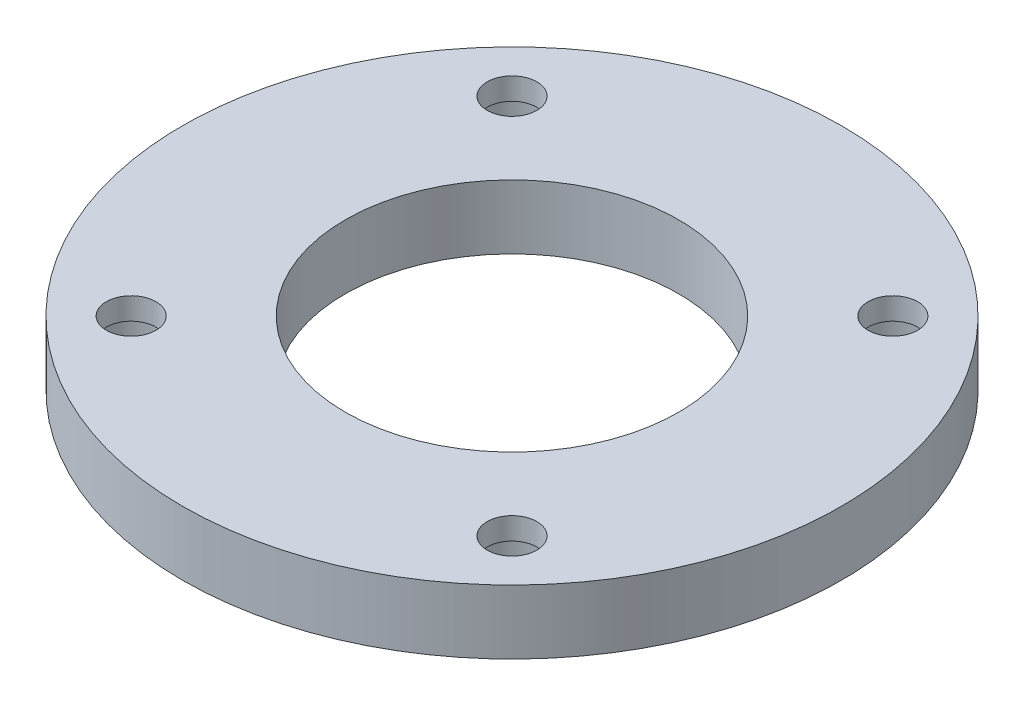
ISO-10303-21;
HEADER;
FILE_DESCRIPTION(('STEP AP214'),'2;1');
FILE_NAME('part.step','',(''),(''),'','','');
FILE_SCHEMA(('AUTOMOTIVE_DESIGN { 1 0 10303 214 1 1 1 1 }'));
ENDSEC;
DATA;
#1=APPLICATION_CONTEXT('core data for automotive mechanical design processes');
#2=APPLICATION_PROTOCOL_DEFINITION('international standard','automotive_design',2000,#1);
#3=PRODUCT_CONTEXT('',#1,'mechanical');
#4=PRODUCT('Part','Part','',(#3));
#5=PRODUCT_RELATED_PRODUCT_CATEGORY('part','',(#4));
#6=PRODUCT_DEFINITION_FORMATION('','',#4);
#7=PRODUCT_DEFINITION_CONTEXT('part definition',#1,'design');
#8=PRODUCT_DEFINITION('design','',#6,#7);
#9=PRODUCT_DEFINITION_SHAPE('','',#8);
#10=(LENGTH_UNIT() NAMED_UNIT(*) SI_UNIT(.MILLI.,.METRE.));
#11=(NAMED_UNIT(*) PLANE_ANGLE_UNIT() SI_UNIT($,.RADIAN.));
#12=(NAMED_UNIT(*) SI_UNIT($,.STERADIAN.) SOLID_ANGLE_UNIT());
#13=UNCERTAINTY_MEASURE_WITH_UNIT(LENGTH_MEASURE(1.E-05),#10,'distance_accuracy_value','');
#14=(GEOMETRIC_REPRESENTATION_CONTEXT(3) GLOBAL_UNCERTAINTY_ASSIGNED_CONTEXT((#13)) GLOBAL_UNIT_ASSIGNED_CONTEXT((#10,
#11,#12)) REPRESENTATION_CONTEXT('',''));
#15=CARTESIAN_POINT('',(0.,0.,0.));
#16=DIRECTION('',(0.,0.,1.));
#17=DIRECTION('',(1.,0.,0.));
#18=AXIS2_PLACEMENT_3D('',#15,#16,#17);
#19=CARTESIAN_POINT('',(0.,6.35,0.));
#20=DIRECTION('',(0.,1.,0.));
#21=DIRECTION('',(0.,0.,1.));
#22=AXIS2_PLACEMENT_3D('',#19,#20,#21);
#23=PLANE('',#22);
#24=CARTESIAN_POINT('',(-18.8585378542452,6.35,18.8585378542452));
#25=DIRECTION('',(0.,-1.,0.));
#26=DIRECTION('',(0.,0.,-1.));
#27=AXIS2_PLACEMENT_3D('',#24,#25,#26);
#28=CIRCLE('',#27,2.45745);
#29=CARTESIAN_POINT('',(-18.8585378542452,6.35,16.4010878542452));
#30=VERTEX_POINT('',#29);
#31=EDGE_CURVE('E86',#30,#30,#28,.T.);
#32=ORIENTED_EDGE('',*,*,#31,.T.);
#33=EDGE_LOOP('',(#32));
#34=FACE_BOUND('',#33,.T.);
#35=CARTESIAN_POINT('',(18.8585378542452,6.35,18.8585378542452));
#36=DIRECTION('',(0.,-1.,0.));
#37=DIRECTION('',(0.,0.,-1.));
#38=AXIS2_PLACEMENT_3D('',#35,#36,#37);
#39=CIRCLE('',#38,2.45745);
#40=CARTESIAN_POINT('',(18.8585378542452,6.35,16.4010878542452));
#41=VERTEX_POINT('',#40);
#42=EDGE_CURVE('E74',#41,#41,#39,.T.);
#43=ORIENTED_EDGE('',*,*,#42,.T.);
#44=EDGE_LOOP('',(#43));
#45=FACE_BOUND('',#44,.T.);
#46=CARTESIAN_POINT('',(18.8585378542452,6.35,-18.8585378542452));
#47=DIRECTION('',(0.,-1.,0.));
#48=DIRECTION('',(0.,0.,-1.));
#49=AXIS2_PLACEMENT_3D('',#46,#47,#48);
#50=CIRCLE('',#49,2.45745);
#51=CARTESIAN_POINT('',(18.8585378542452,6.35,-21.3159878542452));
#52=VERTEX_POINT('',#51);
#53=EDGE_CURVE('E62',#52,#52,#50,.T.);
#54=ORIENTED_EDGE('',*,*,#53,.T.);
#55=EDGE_LOOP('',(#54));
#56=FACE_BOUND('',#55,.T.);
#57=CARTESIAN_POINT('',(-18.8585378542452,6.35,-18.8585378542452));
#58=DIRECTION('',(0.,-1.,0.));
#59=DIRECTION('',(0.,0.,-1.));
#60=AXIS2_PLACEMENT_3D('',#57,#58,#59);
#61=CIRCLE('',#60,2.45745);
#62=CARTESIAN_POINT('',(-18.8585378542452,6.35,-21.3159878542452));
#63=VERTEX_POINT('',#62);
#64=EDGE_CURVE('E48',#63,#63,#61,.T.);
#65=ORIENTED_EDGE('',*,*,#64,.T.);
#66=EDGE_LOOP('',(#65));
#67=FACE_BOUND('',#66,.T.);
#68=CARTESIAN_POINT('',(0.,6.35,0.));
#69=DIRECTION('',(0.,1.,0.));
#70=DIRECTION('',(0.,0.,1.));
#71=AXIS2_PLACEMENT_3D('',#68,#69,#70);
#72=CIRCLE('',#71,32.639);
#73=CARTESIAN_POINT('',(0.,6.35,32.639));
#74=VERTEX_POINT('',#73);
#75=EDGE_CURVE('E10',#74,#74,#72,.T.);
#76=ORIENTED_EDGE('',*,*,#75,.T.);
#77=EDGE_LOOP('',(#76));
#78=FACE_BOUND('',#77,.T.);
#79=CARTESIAN_POINT('',(0.,6.35,0.));
#80=DIRECTION('',(0.,1.,0.));
#81=DIRECTION('',(0.,0.,1.));
#82=AXIS2_PLACEMENT_3D('',#79,#80,#81);
#83=CIRCLE('',#82,16.51);
#84=CARTESIAN_POINT('',(0.,6.35,16.51));
#85=VERTEX_POINT('',#84);
#86=EDGE_CURVE('E43',#85,#85,#83,.T.);
#87=ORIENTED_EDGE('',*,*,#86,.F.);
#88=EDGE_LOOP('',(#87));
#89=FACE_BOUND('',#88,.T.);
#90=ADVANCED_FACE('F32',(#34,#45,#56,#67,#78,#89),#23,.T.);
#91=CARTESIAN_POINT('',(0.,0.,0.));
#92=DIRECTION('',(0.,1.,0.));
#93=DIRECTION('',(0.,0.,1.));
#94=AXIS2_PLACEMENT_3D('',#91,#92,#93);
#95=PLANE('',#94);
#96=CARTESIAN_POINT('',(-18.8585378542452,0.,18.8585378542452));
#97=DIRECTION('',(0.,-1.,0.));
#98=DIRECTION('',(0.,0.,-1.));
#99=AXIS2_PLACEMENT_3D('',#96,#97,#98);
#100=CIRCLE('',#99,3.96875);
#101=CARTESIAN_POINT('',(-18.8585378542452,0.,14.8897878542452));
#102=VERTEX_POINT('',#101);
#103=EDGE_CURVE('E95',#102,#102,#100,.T.);
#104=ORIENTED_EDGE('',*,*,#103,.F.);
#105=EDGE_LOOP('',(#104));
#106=FACE_BOUND('',#105,.T.);
#107=CARTESIAN_POINT('',(18.8585378542452,0.,18.8585378542452));
#108=DIRECTION('',(0.,-1.,0.));
#109=DIRECTION('',(0.,0.,-1.));
#110=AXIS2_PLACEMENT_3D('',#107,#108,#109);
#111=CIRCLE('',#110,3.96875);
#112=CARTESIAN_POINT('',(18.8585378542452,0.,14.8897878542452));
#113=VERTEX_POINT('',#112);
#114=EDGE_CURVE('E83',#113,#113,#111,.T.);
#115=ORIENTED_EDGE('',*,*,#114,.F.);
#116=EDGE_LOOP('',(#115));
#117=FACE_BOUND('',#116,.T.);
#118=CARTESIAN_POINT('',(18.8585378542452,0.,-18.8585378542452));
#119=DIRECTION('',(0.,-1.,0.));
#120=DIRECTION('',(0.,0.,-1.));
#121=AXIS2_PLACEMENT_3D('',#118,#119,#120);
#122=CIRCLE('',#121,3.96875);
#123=CARTESIAN_POINT('',(18.8585378542452,0.,-22.8272878542452));
#124=VERTEX_POINT('',#123);
#125=EDGE_CURVE('E71',#124,#124,#122,.T.);
#126=ORIENTED_EDGE('',*,*,#125,.F.);
#127=EDGE_LOOP('',(#126));
#128=FACE_BOUND('',#127,.T.);
#129=CARTESIAN_POINT('',(-18.8585378542452,0.,-18.8585378542452));
#130=DIRECTION('',(0.,-1.,0.));
#131=DIRECTION('',(0.,0.,-1.));
#132=AXIS2_PLACEMENT_3D('',#129,#130,#131);
#133=CIRCLE('',#132,3.96875);
#134=CARTESIAN_POINT('',(-18.8585378542452,0.,-22.8272878542452));
#135=VERTEX_POINT('',#134);
#136=EDGE_CURVE('E59',#135,#135,#133,.T.);
#137=ORIENTED_EDGE('',*,*,#136,.F.);
#138=EDGE_LOOP('',(#137));
#139=FACE_BOUND('',#138,.T.);
#140=CARTESIAN_POINT('',(0.,0.,0.));
#141=DIRECTION('',(0.,1.,0.));
#142=DIRECTION('',(0.,0.,1.));
#143=AXIS2_PLACEMENT_3D('',#140,#141,#142);
#144=CIRCLE('',#143,32.639);
#145=CARTESIAN_POINT('',(0.,0.,32.639));
#146=VERTEX_POINT('',#145);
#147=EDGE_CURVE('E36',#146,#146,#144,.T.);
#148=ORIENTED_EDGE('',*,*,#147,.F.);
#149=EDGE_LOOP('',(#148));
#150=FACE_BOUND('',#149,.T.);
#151=CARTESIAN_POINT('',(0.,0.,0.));
#152=DIRECTION('',(0.,1.,0.));
#153=DIRECTION('',(0.,0.,1.));
#154=AXIS2_PLACEMENT_3D('',#151,#152,#153);
#155=CIRCLE('',#154,16.51);
#156=CARTESIAN_POINT('',(0.,0.,16.51));
#157=VERTEX_POINT('',#156);
#158=EDGE_CURVE('E45',#157,#157,#155,.T.);
#159=ORIENTED_EDGE('',*,*,#158,.T.);
#160=EDGE_LOOP('',(#159));
#161=FACE_BOUND('',#160,.T.);
#162=ADVANCED_FACE('F101',(#106,#117,#128,#139,#150,#161),#95,.F.);
#163=CARTESIAN_POINT('',(0.,6.35,0.));
#164=DIRECTION('',(0.,-1.,0.));
#165=DIRECTION('',(0.,0.,-1.));
#166=AXIS2_PLACEMENT_3D('',#163,#164,#165);
#167=CYLINDRICAL_SURFACE('',#166,32.639);
#168=ORIENTED_EDGE('',*,*,#75,.F.);
#169=EDGE_LOOP('',(#168));
#170=FACE_BOUND('',#169,.T.);
#171=ORIENTED_EDGE('',*,*,#147,.T.);
#172=EDGE_LOOP('',(#171));
#173=FACE_BOUND('',#172,.T.);
#174=ADVANCED_FACE('F34',(#170,#173),#167,.T.);
#175=CARTESIAN_POINT('',(0.,6.35,0.));
#176=DIRECTION('',(0.,-1.,0.));
#177=DIRECTION('',(0.,0.,-1.));
#178=AXIS2_PLACEMENT_3D('',#175,#176,#177);
#179=CYLINDRICAL_SURFACE('',#178,16.51);
#180=ORIENTED_EDGE('',*,*,#86,.T.);
#181=EDGE_LOOP('',(#180));
#182=FACE_BOUND('',#181,.T.);
#183=ORIENTED_EDGE('',*,*,#158,.F.);
#184=EDGE_LOOP('',(#183));
#185=FACE_BOUND('',#184,.T.);
#186=ADVANCED_FACE('F114',(#182,#185),#179,.F.);
#187=CARTESIAN_POINT('',(-18.8585378542452,0.,-18.8585378542452));
#188=DIRECTION('',(0.,-1.,0.));
#189=DIRECTION('',(0.,0.,-1.));
#190=AXIS2_PLACEMENT_3D('',#187,#188,#189);
#191=CYLINDRICAL_SURFACE('',#190,2.45745);
#192=ORIENTED_EDGE('',*,*,#64,.F.);
#193=EDGE_LOOP('',(#192));
#194=FACE_BOUND('',#193,.T.);
#195=CARTESIAN_POINT('',(-18.8585378542452,4.1656,-18.8585378542452));
#196=DIRECTION('',(0.,-1.,0.));
#197=DIRECTION('',(0.,0.,-1.));
#198=AXIS2_PLACEMENT_3D('',#195,#196,#197);
#199=CIRCLE('',#198,2.45745);
#200=CARTESIAN_POINT('',(-18.8585378542452,4.1656,-21.3159878542452));
#201=VERTEX_POINT('',#200);
#202=EDGE_CURVE('E53',#201,#201,#199,.T.);
#203=ORIENTED_EDGE('',*,*,#202,.T.);
#204=EDGE_LOOP('',(#203));
#205=FACE_BOUND('',#204,.T.);
#206=ADVANCED_FACE('F116',(#194,#205),#191,.F.);
#207=CARTESIAN_POINT('',(-16.4010878542452,4.1656,-18.8585378542452));
#208=DIRECTION('',(0.,1.,0.));
#209=DIRECTION('',(0.,0.,1.));
#210=AXIS2_PLACEMENT_3D('',#207,#208,#209);
#211=PLANE('',#210);
#212=ORIENTED_EDGE('',*,*,#202,.F.);
#213=EDGE_LOOP('',(#212));
#214=FACE_BOUND('',#213,.T.);
#215=CARTESIAN_POINT('',(-18.8585378542452,4.1656,-18.8585378542452));
#216=DIRECTION('',(0.,-1.,0.));
#217=DIRECTION('',(0.,0.,-1.));
#218=AXIS2_PLACEMENT_3D('',#215,#216,#217);
#219=CIRCLE('',#218,3.96875);
#220=CARTESIAN_POINT('',(-18.8585378542452,4.1656,-22.8272878542452));
#221=VERTEX_POINT('',#220);
#222=EDGE_CURVE('E56',#221,#221,#219,.T.);
#223=ORIENTED_EDGE('',*,*,#222,.T.);
#224=EDGE_LOOP('',(#223));
#225=FACE_BOUND('',#224,.T.);
#226=ADVANCED_FACE('F123',(#214,#225),#211,.F.);
#227=CARTESIAN_POINT('',(-18.8585378542452,0.,-18.8585378542452));
#228=DIRECTION('',(0.,-1.,0.));
#229=DIRECTION('',(0.,0.,-1.));
#230=AXIS2_PLACEMENT_3D('',#227,#228,#229);
#231=CYLINDRICAL_SURFACE('',#230,3.96875);
#232=ORIENTED_EDGE('',*,*,#222,.F.);
#233=EDGE_LOOP('',(#232));
#234=FACE_BOUND('',#233,.T.);
#235=ORIENTED_EDGE('',*,*,#136,.T.);
#236=EDGE_LOOP('',(#235));
#237=FACE_BOUND('',#236,.T.);
#238=ADVANCED_FACE('F146',(#234,#237),#231,.F.);
#239=CARTESIAN_POINT('',(18.8585378542452,0.,-18.8585378542452));
#240=DIRECTION('',(0.,-1.,0.));
#241=DIRECTION('',(0.,0.,-1.));
#242=AXIS2_PLACEMENT_3D('',#239,#240,#241);
#243=CYLINDRICAL_SURFACE('',#242,2.45745);
#244=ORIENTED_EDGE('',*,*,#53,.F.);
#245=EDGE_LOOP('',(#244));
#246=FACE_BOUND('',#245,.T.);
#247=CARTESIAN_POINT('',(18.8585378542452,4.1656,-18.8585378542452));
#248=DIRECTION('',(0.,-1.,0.));
#249=DIRECTION('',(0.,0.,-1.));
#250=AXIS2_PLACEMENT_3D('',#247,#248,#249);
#251=CIRCLE('',#250,2.45745);
#252=CARTESIAN_POINT('',(18.8585378542452,4.1656,-21.3159878542452));
#253=VERTEX_POINT('',#252);
#254=EDGE_CURVE('E65',#253,#253,#251,.T.);
#255=ORIENTED_EDGE('',*,*,#254,.T.);
#256=EDGE_LOOP('',(#255));
#257=FACE_BOUND('',#256,.T.);
#258=ADVANCED_FACE('F152',(#246,#257),#243,.F.);
#259=CARTESIAN_POINT('',(21.3159878542452,4.1656,-18.8585378542452));
#260=DIRECTION('',(0.,1.,0.));
#261=DIRECTION('',(0.,0.,1.));
#262=AXIS2_PLACEMENT_3D('',#259,#260,#261);
#263=PLANE('',#262);
#264=ORIENTED_EDGE('',*,*,#254,.F.);
#265=EDGE_LOOP('',(#264));
#266=FACE_BOUND('',#265,.T.);
#267=CARTESIAN_POINT('',(18.8585378542452,4.1656,-18.8585378542452));
#268=DIRECTION('',(0.,-1.,0.));
#269=DIRECTION('',(0.,0.,-1.));
#270=AXIS2_PLACEMENT_3D('',#267,#268,#269);
#271=CIRCLE('',#270,3.96875);
#272=CARTESIAN_POINT('',(18.8585378542452,4.1656,-22.8272878542452));
#273=VERTEX_POINT('',#272);
#274=EDGE_CURVE('E68',#273,#273,#271,.T.);
#275=ORIENTED_EDGE('',*,*,#274,.T.);
#276=EDGE_LOOP('',(#275));
#277=FACE_BOUND('',#276,.T.);
#278=ADVANCED_FACE('F157',(#266,#277),#263,.F.);
#279=CARTESIAN_POINT('',(18.8585378542452,0.,-18.8585378542452));
#280=DIRECTION('',(0.,-1.,0.));
#281=DIRECTION('',(0.,0.,-1.));
#282=AXIS2_PLACEMENT_3D('',#279,#280,#281);
#283=CYLINDRICAL_SURFACE('',#282,3.96875);
#284=ORIENTED_EDGE('',*,*,#274,.F.);
#285=EDGE_LOOP('',(#284));
#286=FACE_BOUND('',#285,.T.);
#287=ORIENTED_EDGE('',*,*,#125,.T.);
#288=EDGE_LOOP('',(#287));
#289=FACE_BOUND('',#288,.T.);
#290=ADVANCED_FACE('F163',(#286,#289),#283,.F.);
#291=CARTESIAN_POINT('',(18.8585378542452,0.,18.8585378542452));
#292=DIRECTION('',(0.,-1.,0.));
#293=DIRECTION('',(0.,0.,-1.));
#294=AXIS2_PLACEMENT_3D('',#291,#292,#293);
#295=CYLINDRICAL_SURFACE('',#294,2.45745);
#296=ORIENTED_EDGE('',*,*,#42,.F.);
#297=EDGE_LOOP('',(#296));
#298=FACE_BOUND('',#297,.T.);
#299=CARTESIAN_POINT('',(18.8585378542452,4.1656,18.8585378542452));
#300=DIRECTION('',(0.,-1.,0.));
#301=DIRECTION('',(0.,0.,-1.));
#302=AXIS2_PLACEMENT_3D('',#299,#300,#301);
#303=CIRCLE('',#302,2.45745);
#304=CARTESIAN_POINT('',(18.8585378542452,4.1656,16.4010878542452));
#305=VERTEX_POINT('',#304);
#306=EDGE_CURVE('E77',#305,#305,#303,.T.);
#307=ORIENTED_EDGE('',*,*,#306,.T.);
#308=EDGE_LOOP('',(#307));
#309=FACE_BOUND('',#308,.T.);
#310=ADVANCED_FACE('F167',(#298,#309),#295,.F.);
#311=CARTESIAN_POINT('',(21.3159878542452,4.1656,18.8585378542452));
#312=DIRECTION('',(0.,1.,0.));
#313=DIRECTION('',(0.,0.,1.));
#314=AXIS2_PLACEMENT_3D('',#311,#312,#313);
#315=PLANE('',#314);
#316=ORIENTED_EDGE('',*,*,#306,.F.);
#317=EDGE_LOOP('',(#316));
#318=FACE_BOUND('',#317,.T.);
#319=CARTESIAN_POINT('',(18.8585378542452,4.1656,18.8585378542452));
#320=DIRECTION('',(0.,-1.,0.));
#321=DIRECTION('',(0.,0.,-1.));
#322=AXIS2_PLACEMENT_3D('',#319,#320,#321);
#323=CIRCLE('',#322,3.96875);
#324=CARTESIAN_POINT('',(18.8585378542452,4.1656,14.8897878542452));
#325=VERTEX_POINT('',#324);
#326=EDGE_CURVE('E80',#325,#325,#323,.T.);
#327=ORIENTED_EDGE('',*,*,#326,.T.);
#328=EDGE_LOOP('',(#327));
#329=FACE_BOUND('',#328,.T.);
#330=ADVANCED_FACE('F171',(#318,#329),#315,.F.);
#331=CARTESIAN_POINT('',(18.8585378542452,0.,18.8585378542452));
#332=DIRECTION('',(0.,-1.,0.));
#333=DIRECTION('',(0.,0.,-1.));
#334=AXIS2_PLACEMENT_3D('',#331,#332,#333);
#335=CYLINDRICAL_SURFACE('',#334,3.96875);
#336=ORIENTED_EDGE('',*,*,#326,.F.);
#337=EDGE_LOOP('',(#336));
#338=FACE_BOUND('',#337,.T.);
#339=ORIENTED_EDGE('',*,*,#114,.T.);
#340=EDGE_LOOP('',(#339));
#341=FACE_BOUND('',#340,.T.);
#342=ADVANCED_FACE('F175',(#338,#341),#335,.F.);
#343=CARTESIAN_POINT('',(-18.8585378542452,0.,18.8585378542452));
#344=DIRECTION('',(0.,-1.,0.));
#345=DIRECTION('',(0.,0.,-1.));
#346=AXIS2_PLACEMENT_3D('',#343,#344,#345);
#347=CYLINDRICAL_SURFACE('',#346,2.45745);
#348=ORIENTED_EDGE('',*,*,#31,.F.);
#349=EDGE_LOOP('',(#348));
#350=FACE_BOUND('',#349,.T.);
#351=CARTESIAN_POINT('',(-18.8585378542452,4.1656,18.8585378542452));
#352=DIRECTION('',(0.,-1.,0.));
#353=DIRECTION('',(0.,0.,-1.));
#354=AXIS2_PLACEMENT_3D('',#351,#352,#353);
#355=CIRCLE('',#354,2.45745);
#356=CARTESIAN_POINT('',(-18.8585378542452,4.1656,16.4010878542452));
#357=VERTEX_POINT('',#356);
#358=EDGE_CURVE('E89',#357,#357,#355,.T.);
#359=ORIENTED_EDGE('',*,*,#358,.T.);
#360=EDGE_LOOP('',(#359));
#361=FACE_BOUND('',#360,.T.);
#362=ADVANCED_FACE('F179',(#350,#361),#347,.F.);
#363=CARTESIAN_POINT('',(-16.4010878542452,4.1656,18.8585378542452));
#364=DIRECTION('',(0.,1.,0.));
#365=DIRECTION('',(0.,0.,1.));
#366=AXIS2_PLACEMENT_3D('',#363,#364,#365);
#367=PLANE('',#366);
#368=ORIENTED_EDGE('',*,*,#358,.F.);
#369=EDGE_LOOP('',(#368));
#370=FACE_BOUND('',#369,.T.);
#371=CARTESIAN_POINT('',(-18.8585378542452,4.1656,18.8585378542452));
#372=DIRECTION('',(0.,-1.,0.));
#373=DIRECTION('',(0.,0.,-1.));
#374=AXIS2_PLACEMENT_3D('',#371,#372,#373);
#375=CIRCLE('',#374,3.96875);
#376=CARTESIAN_POINT('',(-18.8585378542452,4.1656,14.8897878542452));
#377=VERTEX_POINT('',#376);
#378=EDGE_CURVE('E92',#377,#377,#375,.T.);
#379=ORIENTED_EDGE('',*,*,#378,.T.);
#380=EDGE_LOOP('',(#379));
#381=FACE_BOUND('',#380,.T.);
#382=ADVANCED_FACE('F183',(#370,#381),#367,.F.);
#383=CARTESIAN_POINT('',(-18.8585378542452,0.,18.8585378542452));
#384=DIRECTION('',(0.,-1.,0.));
#385=DIRECTION('',(0.,0.,-1.));
#386=AXIS2_PLACEMENT_3D('',#383,#384,#385);
#387=CYLINDRICAL_SURFACE('',#386,3.96875);
#388=ORIENTED_EDGE('',*,*,#378,.F.);
#389=EDGE_LOOP('',(#388));
#390=FACE_BOUND('',#389,.T.);
#391=ORIENTED_EDGE('',*,*,#103,.T.);
#392=EDGE_LOOP('',(#391));
#393=FACE_BOUND('',#392,.T.);
#394=ADVANCED_FACE('F99',(#390,#393),#387,.F.);
#395=CLOSED_SHELL('',(#90,#162,#174,#186,#206,#226,#238,#258,#278,#290,#310,#330,#342,#362,#382,#394));
#396=MANIFOLD_SOLID_BREP('B2',#395);
#397=ADVANCED_BREP_SHAPE_REPRESENTATION('',(#18,#396),#14);
#398=SHAPE_DEFINITION_REPRESENTATION(#9,#397);
ENDSEC;
END-ISO-10303-21;
